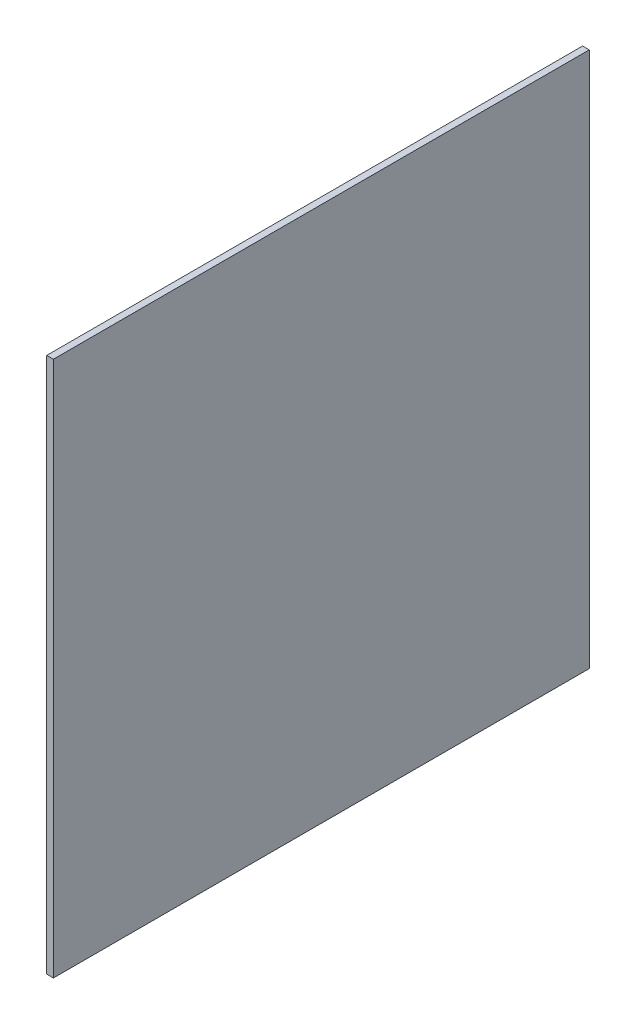
ISO-10303-21;
HEADER;
FILE_DESCRIPTION(('STEP AP214'),'2;1');
FILE_NAME('part.step','',(''),(''),'','','');
FILE_SCHEMA(('AUTOMOTIVE_DESIGN { 1 0 10303 214 1 1 1 1 }'));
ENDSEC;
DATA;
#1=APPLICATION_CONTEXT('core data for automotive mechanical design processes');
#2=APPLICATION_PROTOCOL_DEFINITION('international standard','automotive_design',2000,#1);
#3=PRODUCT_CONTEXT('',#1,'mechanical');
#4=PRODUCT('Part','Part','',(#3));
#5=PRODUCT_RELATED_PRODUCT_CATEGORY('part','',(#4));
#6=PRODUCT_DEFINITION_FORMATION('','',#4);
#7=PRODUCT_DEFINITION_CONTEXT('part definition',#1,'design');
#8=PRODUCT_DEFINITION('design','',#6,#7);
#9=PRODUCT_DEFINITION_SHAPE('','',#8);
#10=(LENGTH_UNIT() NAMED_UNIT(*) SI_UNIT(.MILLI.,.METRE.));
#11=(NAMED_UNIT(*) PLANE_ANGLE_UNIT() SI_UNIT($,.RADIAN.));
#12=(NAMED_UNIT(*) SI_UNIT($,.STERADIAN.) SOLID_ANGLE_UNIT());
#13=UNCERTAINTY_MEASURE_WITH_UNIT(LENGTH_MEASURE(1.E-05),#10,'distance_accuracy_value','');
#14=(GEOMETRIC_REPRESENTATION_CONTEXT(3) GLOBAL_UNCERTAINTY_ASSIGNED_CONTEXT((#13)) GLOBAL_UNIT_ASSIGNED_CONTEXT((#10,
#11,#12)) REPRESENTATION_CONTEXT('',''));
#15=CARTESIAN_POINT('',(0.,0.,0.));
#16=DIRECTION('',(0.,0.,1.));
#17=DIRECTION('',(1.,0.,0.));
#18=AXIS2_PLACEMENT_3D('',#15,#16,#17);
#19=CARTESIAN_POINT('',(127.,-120.585786437627,-120.585786437627));
#20=DIRECTION('',(0.,0.,1.));
#21=DIRECTION('',(1.,0.,0.));
#22=AXIS2_PLACEMENT_3D('',#19,#20,#21);
#23=PLANE('',#22);
#24=DIRECTION('',(0.,1.,0.));
#25=VECTOR('',#24,1.);
#26=CARTESIAN_POINT('',(124.,-120.585786437627,-120.585786437627));
#27=LINE('',#26,#25);
#28=CARTESIAN_POINT('',(124.,-120.585786437627,-120.585786437627));
#29=VERTEX_POINT('',#28);
#30=CARTESIAN_POINT('',(124.,120.585786437627,-120.585786437627));
#31=VERTEX_POINT('',#30);
#32=EDGE_CURVE('E107',#29,#31,#27,.T.);
#33=ORIENTED_EDGE('',*,*,#32,.T.);
#34=DIRECTION('',(-1.,0.,0.));
#35=VECTOR('',#34,1.);
#36=CARTESIAN_POINT('',(127.,120.585786437627,-120.585786437627));
#37=LINE('',#36,#35);
#38=CARTESIAN_POINT('',(127.,120.585786437627,-120.585786437627));
#39=VERTEX_POINT('',#38);
#40=EDGE_CURVE('E11',#39,#31,#37,.T.);
#41=ORIENTED_EDGE('',*,*,#40,.F.);
#42=DIRECTION('',(0.,1.,0.));
#43=VECTOR('',#42,1.);
#44=CARTESIAN_POINT('',(127.,-120.585786437627,-120.585786437627));
#45=LINE('',#44,#43);
#46=CARTESIAN_POINT('',(127.,-120.585786437627,-120.585786437627));
#47=VERTEX_POINT('',#46);
#48=EDGE_CURVE('E91',#47,#39,#45,.T.);
#49=ORIENTED_EDGE('',*,*,#48,.F.);
#50=DIRECTION('',(-1.,0.,0.));
#51=VECTOR('',#50,1.);
#52=CARTESIAN_POINT('',(127.,-120.585786437627,-120.585786437627));
#53=LINE('',#52,#51);
#54=EDGE_CURVE('E103',#47,#29,#53,.T.);
#55=ORIENTED_EDGE('',*,*,#54,.T.);
#56=EDGE_LOOP('',(#33,#41,#49,#55));
#57=FACE_BOUND('',#56,.T.);
#58=ADVANCED_FACE('F39',(#57),#23,.F.);
#59=CARTESIAN_POINT('',(127.,120.585786437627,120.585786437627));
#60=DIRECTION('',(0.,-1.,0.));
#61=DIRECTION('',(0.,0.,-1.));
#62=AXIS2_PLACEMENT_3D('',#59,#60,#61);
#63=PLANE('',#62);
#64=DIRECTION('',(0.,0.,1.));
#65=VECTOR('',#64,1.);
#66=CARTESIAN_POINT('',(124.,120.585786437627,120.585786437627));
#67=LINE('',#66,#65);
#68=CARTESIAN_POINT('',(124.,120.585786437627,120.585786437627));
#69=VERTEX_POINT('',#68);
#70=EDGE_CURVE('E96',#31,#69,#67,.T.);
#71=ORIENTED_EDGE('',*,*,#70,.T.);
#72=DIRECTION('',(-1.,0.,0.));
#73=VECTOR('',#72,1.);
#74=CARTESIAN_POINT('',(127.,120.585786437627,120.585786437627));
#75=LINE('',#74,#73);
#76=CARTESIAN_POINT('',(127.,120.585786437627,120.585786437627));
#77=VERTEX_POINT('',#76);
#78=EDGE_CURVE('E48',#77,#69,#75,.T.);
#79=ORIENTED_EDGE('',*,*,#78,.F.);
#80=DIRECTION('',(0.,0.,1.));
#81=VECTOR('',#80,1.);
#82=CARTESIAN_POINT('',(127.,120.585786437627,120.585786437627));
#83=LINE('',#82,#81);
#84=EDGE_CURVE('E86',#39,#77,#83,.T.);
#85=ORIENTED_EDGE('',*,*,#84,.F.);
#86=ORIENTED_EDGE('',*,*,#40,.T.);
#87=EDGE_LOOP('',(#71,#79,#85,#86));
#88=FACE_BOUND('',#87,.T.);
#89=ADVANCED_FACE('F95',(#88),#63,.F.);
#90=CARTESIAN_POINT('',(127.,-120.585786437627,120.585786437627));
#91=DIRECTION('',(0.,0.,-1.));
#92=DIRECTION('',(-1.,0.,0.));
#93=AXIS2_PLACEMENT_3D('',#90,#91,#92);
#94=PLANE('',#93);
#95=DIRECTION('',(0.,-1.,0.));
#96=VECTOR('',#95,1.);
#97=CARTESIAN_POINT('',(124.,-120.585786437627,120.585786437627));
#98=LINE('',#97,#96);
#99=CARTESIAN_POINT('',(124.,-120.585786437627,120.585786437627));
#100=VERTEX_POINT('',#99);
#101=EDGE_CURVE('E73',#69,#100,#98,.T.);
#102=ORIENTED_EDGE('',*,*,#101,.T.);
#103=DIRECTION('',(-1.,0.,0.));
#104=VECTOR('',#103,1.);
#105=CARTESIAN_POINT('',(127.,-120.585786437627,120.585786437627));
#106=LINE('',#105,#104);
#107=CARTESIAN_POINT('',(127.,-120.585786437627,120.585786437627));
#108=VERTEX_POINT('',#107);
#109=EDGE_CURVE('E98',#108,#100,#106,.T.);
#110=ORIENTED_EDGE('',*,*,#109,.F.);
#111=DIRECTION('',(0.,-1.,0.));
#112=VECTOR('',#111,1.);
#113=CARTESIAN_POINT('',(127.,-120.585786437627,120.585786437627));
#114=LINE('',#113,#112);
#115=EDGE_CURVE('E89',#77,#108,#114,.T.);
#116=ORIENTED_EDGE('',*,*,#115,.F.);
#117=ORIENTED_EDGE('',*,*,#78,.T.);
#118=EDGE_LOOP('',(#102,#110,#116,#117));
#119=FACE_BOUND('',#118,.T.);
#120=ADVANCED_FACE('F99',(#119),#94,.F.);
#121=CARTESIAN_POINT('',(127.,-120.585786437627,120.585786437627));
#122=DIRECTION('',(0.,1.,0.));
#123=DIRECTION('',(0.,0.,1.));
#124=AXIS2_PLACEMENT_3D('',#121,#122,#123);
#125=PLANE('',#124);
#126=DIRECTION('',(0.,0.,-1.));
#127=VECTOR('',#126,1.);
#128=CARTESIAN_POINT('',(124.,-120.585786437627,120.585786437627));
#129=LINE('',#128,#127);
#130=EDGE_CURVE('E79',#100,#29,#129,.T.);
#131=ORIENTED_EDGE('',*,*,#130,.T.);
#132=ORIENTED_EDGE('',*,*,#54,.F.);
#133=DIRECTION('',(0.,0.,-1.));
#134=VECTOR('',#133,1.);
#135=CARTESIAN_POINT('',(127.,-120.585786437627,120.585786437627));
#136=LINE('',#135,#134);
#137=EDGE_CURVE('E56',#108,#47,#136,.T.);
#138=ORIENTED_EDGE('',*,*,#137,.F.);
#139=ORIENTED_EDGE('',*,*,#109,.T.);
#140=EDGE_LOOP('',(#131,#132,#138,#139));
#141=FACE_BOUND('',#140,.T.);
#142=ADVANCED_FACE('F120',(#141),#125,.F.);
#143=CARTESIAN_POINT('',(127.,0.,0.));
#144=DIRECTION('',(-1.,0.,0.));
#145=DIRECTION('',(0.,0.,1.));
#146=AXIS2_PLACEMENT_3D('',#143,#144,#145);
#147=PLANE('',#146);
#148=ORIENTED_EDGE('',*,*,#48,.T.);
#149=ORIENTED_EDGE('',*,*,#84,.T.);
#150=ORIENTED_EDGE('',*,*,#115,.T.);
#151=ORIENTED_EDGE('',*,*,#137,.T.);
#152=EDGE_LOOP('',(#148,#149,#150,#151));
#153=FACE_BOUND('',#152,.T.);
#154=ADVANCED_FACE('F87',(#153),#147,.F.);
#155=CARTESIAN_POINT('',(124.,0.,0.));
#156=DIRECTION('',(-1.,0.,0.));
#157=DIRECTION('',(0.,0.,1.));
#158=AXIS2_PLACEMENT_3D('',#155,#156,#157);
#159=PLANE('',#158);
#160=ORIENTED_EDGE('',*,*,#32,.F.);
#161=ORIENTED_EDGE('',*,*,#130,.F.);
#162=ORIENTED_EDGE('',*,*,#101,.F.);
#163=ORIENTED_EDGE('',*,*,#70,.F.);
#164=EDGE_LOOP('',(#160,#161,#162,#163));
#165=FACE_BOUND('',#164,.T.);
#166=ADVANCED_FACE('F123',(#165),#159,.T.);
#167=CLOSED_SHELL('',(#58,#89,#120,#142,#154,#166));
#168=MANIFOLD_SOLID_BREP('B2',#167);
#169=ADVANCED_BREP_SHAPE_REPRESENTATION('',(#18,#168),#14);
#170=SHAPE_DEFINITION_REPRESENTATION(#9,#169);
ENDSEC;
END-ISO-10303-21;
